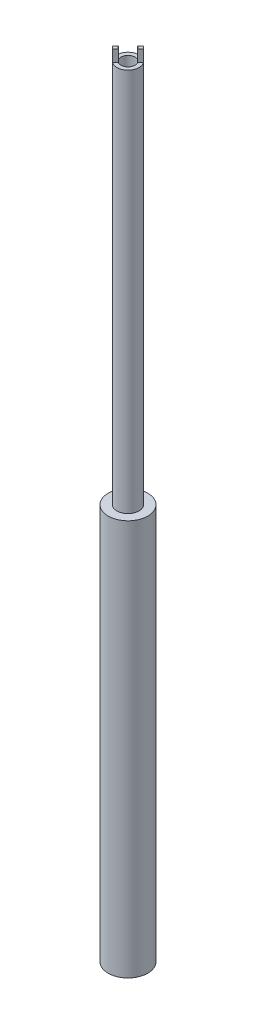
ISO-10303-21;
HEADER;
FILE_DESCRIPTION(('STEP AP214'),'2;1');
FILE_NAME('part.step','',(''),(''),'','','');
FILE_SCHEMA(('AUTOMOTIVE_DESIGN { 1 0 10303 214 1 1 1 1 }'));
ENDSEC;
DATA;
#1=APPLICATION_CONTEXT('core data for automotive mechanical design processes');
#2=APPLICATION_PROTOCOL_DEFINITION('international standard','automotive_design',2000,#1);
#3=PRODUCT_CONTEXT('',#1,'mechanical');
#4=PRODUCT('Part','Part','',(#3));
#5=PRODUCT_RELATED_PRODUCT_CATEGORY('part','',(#4));
#6=PRODUCT_DEFINITION_FORMATION('','',#4);
#7=PRODUCT_DEFINITION_CONTEXT('part definition',#1,'design');
#8=PRODUCT_DEFINITION('design','',#6,#7);
#9=PRODUCT_DEFINITION_SHAPE('','',#8);
#10=(LENGTH_UNIT() NAMED_UNIT(*) SI_UNIT(.MILLI.,.METRE.));
#11=(NAMED_UNIT(*) PLANE_ANGLE_UNIT() SI_UNIT($,.RADIAN.));
#12=(NAMED_UNIT(*) SI_UNIT($,.STERADIAN.) SOLID_ANGLE_UNIT());
#13=UNCERTAINTY_MEASURE_WITH_UNIT(LENGTH_MEASURE(1.E-05),#10,'distance_accuracy_value','');
#14=(GEOMETRIC_REPRESENTATION_CONTEXT(3) GLOBAL_UNCERTAINTY_ASSIGNED_CONTEXT((#13)) GLOBAL_UNIT_ASSIGNED_CONTEXT((#10,
#11,#12)) REPRESENTATION_CONTEXT('',''));
#15=CARTESIAN_POINT('',(0.,0.,0.));
#16=DIRECTION('',(0.,0.,1.));
#17=DIRECTION('',(1.,0.,0.));
#18=AXIS2_PLACEMENT_3D('',#15,#16,#17);
#19=CARTESIAN_POINT('',(0.,100.,0.));
#20=DIRECTION('',(0.,1.,0.));
#21=DIRECTION('',(0.,0.,1.));
#22=AXIS2_PLACEMENT_3D('',#19,#20,#21);
#23=PLANE('',#22);
#24=DIRECTION('',(-0.707106781186551,0.,0.707106781186544));
#25=VECTOR('',#24,1.);
#26=CARTESIAN_POINT('',(1.21975919754681,100.,-0.901561146012855));
#27=LINE('',#26,#25);
#28=CARTESIAN_POINT('',(1.12829869559771,100.,-0.810100644063753));
#29=VERTEX_POINT('',#28);
#30=CARTESIAN_POINT('',(0.767250322731802,100.,-0.449052271197849));
#31=VERTEX_POINT('',#30);
#32=EDGE_CURVE('E99',#29,#31,#27,.T.);
#33=ORIENTED_EDGE('',*,*,#32,.F.);
#34=CARTESIAN_POINT('',(0.,100.,0.));
#35=DIRECTION('',(0.,1.,0.));
#36=DIRECTION('',(0.,0.,1.));
#37=AXIS2_PLACEMENT_3D('',#34,#35,#36);
#38=CIRCLE('',#37,1.389);
#39=CARTESIAN_POINT('',(0.810100644063765,100.,-1.1282986955977));
#40=VERTEX_POINT('',#39);
#41=EDGE_CURVE('E110',#29,#40,#38,.T.);
#42=ORIENTED_EDGE('',*,*,#41,.T.);
#43=DIRECTION('',(0.707106781186551,0.,-0.707106781186544));
#44=VECTOR('',#43,1.);
#45=CARTESIAN_POINT('',(0.901561146012861,100.,-1.2197591975468));
#46=LINE('',#45,#44);
#47=CARTESIAN_POINT('',(0.449052271197857,100.,-0.767250322731797));
#48=VERTEX_POINT('',#47);
#49=EDGE_CURVE('E104',#48,#40,#46,.T.);
#50=ORIENTED_EDGE('',*,*,#49,.F.);
#51=CARTESIAN_POINT('',(0.,100.,0.));
#52=DIRECTION('',(0.,1.,0.));
#53=DIRECTION('',(0.,0.,1.));
#54=AXIS2_PLACEMENT_3D('',#51,#52,#53);
#55=CIRCLE('',#54,0.889);
#56=EDGE_CURVE('E112',#31,#48,#55,.T.);
#57=ORIENTED_EDGE('',*,*,#56,.F.);
#58=EDGE_LOOP('',(#33,#42,#50,#57));
#59=FACE_BOUND('',#58,.T.);
#60=ADVANCED_FACE('F33',(#59),#23,.T.);
#61=CARTESIAN_POINT('',(-0.449052271197857,100.,0.767250322731797));
#62=VERTEX_POINT('',#61);
#63=CARTESIAN_POINT('',(-0.810100644063765,100.,1.1282986955977));
#64=VERTEX_POINT('',#63);
#65=EDGE_CURVE('E114',#62,#64,#27,.T.);
#66=ORIENTED_EDGE('',*,*,#65,.F.);
#67=CARTESIAN_POINT('',(-0.767250322731801,100.,0.449052271197849));
#68=VERTEX_POINT('',#67);
#69=EDGE_CURVE('E121',#68,#62,#55,.T.);
#70=ORIENTED_EDGE('',*,*,#69,.F.);
#71=CARTESIAN_POINT('',(-1.12829869559771,100.,0.810100644063753));
#72=VERTEX_POINT('',#71);
#73=EDGE_CURVE('E161',#72,#68,#46,.T.);
#74=ORIENTED_EDGE('',*,*,#73,.F.);
#75=EDGE_CURVE('E120',#72,#64,#38,.T.);
#76=ORIENTED_EDGE('',*,*,#75,.T.);
#77=EDGE_LOOP('',(#66,#70,#74,#76));
#78=FACE_BOUND('',#77,.T.);
#79=ADVANCED_FACE('F150',(#78),#23,.T.);
#80=CARTESIAN_POINT('',(0.,100.,0.));
#81=DIRECTION('',(0.,-1.,0.));
#82=DIRECTION('',(0.,0.,-1.));
#83=AXIS2_PLACEMENT_3D('',#80,#81,#82);
#84=CYLINDRICAL_SURFACE('',#83,1.389);
#85=ORIENTED_EDGE('',*,*,#41,.F.);
#86=DIRECTION('',(0.,-1.,0.));
#87=VECTOR('',#86,1.);
#88=CARTESIAN_POINT('',(1.12829869559771,100.,-0.810100644063753));
#89=LINE('',#88,#87);
#90=CARTESIAN_POINT('',(1.12829869559771,98.5,-0.810100644063753));
#91=VERTEX_POINT('',#90);
#92=EDGE_CURVE('E96',#29,#91,#89,.T.);
#93=ORIENTED_EDGE('',*,*,#92,.T.);
#94=CARTESIAN_POINT('',(0.,98.5,0.));
#95=DIRECTION('',(0.,1.,0.));
#96=DIRECTION('',(0.,0.,1.));
#97=AXIS2_PLACEMENT_3D('',#94,#95,#96);
#98=CIRCLE('',#97,1.389);
#99=CARTESIAN_POINT('',(-0.810100644063765,98.5,1.1282986955977));
#100=VERTEX_POINT('',#99);
#101=EDGE_CURVE('E184',#100,#91,#98,.T.);
#102=ORIENTED_EDGE('',*,*,#101,.F.);
#103=DIRECTION('',(0.,-1.,0.));
#104=VECTOR('',#103,1.);
#105=CARTESIAN_POINT('',(-0.810100644063765,100.,1.1282986955977));
#106=LINE('',#105,#104);
#107=EDGE_CURVE('E105',#100,#64,#106,.F.);
#108=ORIENTED_EDGE('',*,*,#107,.T.);
#109=ORIENTED_EDGE('',*,*,#75,.F.);
#110=DIRECTION('',(0.,-1.,0.));
#111=VECTOR('',#110,1.);
#112=CARTESIAN_POINT('',(-1.12829869559771,100.,0.810100644063753));
#113=LINE('',#112,#111);
#114=CARTESIAN_POINT('',(-1.12829869559771,98.5,0.810100644063753));
#115=VERTEX_POINT('',#114);
#116=EDGE_CURVE('E162',#72,#115,#113,.T.);
#117=ORIENTED_EDGE('',*,*,#116,.T.);
#118=CARTESIAN_POINT('',(0.,98.5,0.));
#119=DIRECTION('',(0.,-1.,0.));
#120=DIRECTION('',(0.,0.,-1.));
#121=AXIS2_PLACEMENT_3D('',#118,#119,#120);
#122=CIRCLE('',#121,1.389);
#123=CARTESIAN_POINT('',(0.810100644063765,98.5,-1.1282986955977));
#124=VERTEX_POINT('',#123);
#125=EDGE_CURVE('E168',#115,#124,#122,.T.);
#126=ORIENTED_EDGE('',*,*,#125,.T.);
#127=DIRECTION('',(0.,-1.,0.));
#128=VECTOR('',#127,1.);
#129=CARTESIAN_POINT('',(0.810100644063765,100.,-1.1282986955977));
#130=LINE('',#129,#128);
#131=EDGE_CURVE('E119',#124,#40,#130,.F.);
#132=ORIENTED_EDGE('',*,*,#131,.T.);
#133=EDGE_LOOP('',(#85,#93,#102,#108,#109,#117,#126,#132));
#134=FACE_BOUND('',#133,.T.);
#135=CARTESIAN_POINT('',(0.,50.,0.));
#136=DIRECTION('',(0.,1.,0.));
#137=DIRECTION('',(0.,0.,1.));
#138=AXIS2_PLACEMENT_3D('',#135,#136,#137);
#139=CIRCLE('',#138,1.389);
#140=CARTESIAN_POINT('',(0.,50.,1.389));
#141=VERTEX_POINT('',#140);
#142=EDGE_CURVE('E176',#141,#141,#139,.T.);
#143=ORIENTED_EDGE('',*,*,#142,.T.);
#144=EDGE_LOOP('',(#143));
#145=FACE_BOUND('',#144,.T.);
#146=ADVANCED_FACE('F35',(#134,#145),#84,.T.);
#147=CARTESIAN_POINT('',(0.,100.,0.));
#148=DIRECTION('',(0.,-1.,0.));
#149=DIRECTION('',(0.,0.,-1.));
#150=AXIS2_PLACEMENT_3D('',#147,#148,#149);
#151=CYLINDRICAL_SURFACE('',#150,0.889);
#152=DIRECTION('',(0.,-1.,0.));
#153=VECTOR('',#152,1.);
#154=CARTESIAN_POINT('',(0.767250322731802,100.,-0.449052271197849));
#155=LINE('',#154,#153);
#156=CARTESIAN_POINT('',(0.767250322731802,98.5,-0.449052271197849));
#157=VERTEX_POINT('',#156);
#158=EDGE_CURVE('E11',#31,#157,#155,.T.);
#159=ORIENTED_EDGE('',*,*,#158,.F.);
#160=ORIENTED_EDGE('',*,*,#56,.T.);
#161=DIRECTION('',(0.,-1.,0.));
#162=VECTOR('',#161,1.);
#163=CARTESIAN_POINT('',(0.449052271197857,100.,-0.767250322731797));
#164=LINE('',#163,#162);
#165=CARTESIAN_POINT('',(0.449052271197857,98.5,-0.767250322731797));
#166=VERTEX_POINT('',#165);
#167=EDGE_CURVE('E133',#166,#48,#164,.F.);
#168=ORIENTED_EDGE('',*,*,#167,.F.);
#169=CARTESIAN_POINT('',(0.,98.5,0.));
#170=DIRECTION('',(0.,-1.,0.));
#171=DIRECTION('',(0.,0.,-1.));
#172=AXIS2_PLACEMENT_3D('',#169,#170,#171);
#173=CIRCLE('',#172,0.889);
#174=CARTESIAN_POINT('',(-0.767250322731801,98.5,0.449052271197849));
#175=VERTEX_POINT('',#174);
#176=EDGE_CURVE('E131',#175,#166,#173,.T.);
#177=ORIENTED_EDGE('',*,*,#176,.F.);
#178=DIRECTION('',(0.,-1.,0.));
#179=VECTOR('',#178,1.);
#180=CARTESIAN_POINT('',(-0.767250322731801,100.,0.449052271197849));
#181=LINE('',#180,#179);
#182=EDGE_CURVE('E136',#68,#175,#181,.T.);
#183=ORIENTED_EDGE('',*,*,#182,.F.);
#184=ORIENTED_EDGE('',*,*,#69,.T.);
#185=DIRECTION('',(0.,-1.,0.));
#186=VECTOR('',#185,1.);
#187=CARTESIAN_POINT('',(-0.449052271197857,100.,0.767250322731797));
#188=LINE('',#187,#186);
#189=CARTESIAN_POINT('',(-0.449052271197857,98.5,0.767250322731797));
#190=VERTEX_POINT('',#189);
#191=EDGE_CURVE('E41',#190,#62,#188,.F.);
#192=ORIENTED_EDGE('',*,*,#191,.F.);
#193=CARTESIAN_POINT('',(0.,98.5,0.));
#194=DIRECTION('',(0.,1.,0.));
#195=DIRECTION('',(0.,0.,1.));
#196=AXIS2_PLACEMENT_3D('',#193,#194,#195);
#197=CIRCLE('',#196,0.889);
#198=EDGE_CURVE('E138',#190,#157,#197,.T.);
#199=ORIENTED_EDGE('',*,*,#198,.T.);
#200=EDGE_LOOP('',(#159,#160,#168,#177,#183,#184,#192,#199));
#201=FACE_BOUND('',#200,.T.);
#202=CARTESIAN_POINT('',(0.,50.,0.));
#203=DIRECTION('',(0.,1.,0.));
#204=DIRECTION('',(0.,0.,1.));
#205=AXIS2_PLACEMENT_3D('',#202,#203,#204);
#206=CIRCLE('',#205,0.889);
#207=CARTESIAN_POINT('',(0.,50.,0.889));
#208=VERTEX_POINT('',#207);
#209=EDGE_CURVE('E124',#208,#208,#206,.T.);
#210=ORIENTED_EDGE('',*,*,#209,.F.);
#211=EDGE_LOOP('',(#210));
#212=FACE_BOUND('',#211,.T.);
#213=ADVANCED_FACE('F154',(#201,#212),#151,.F.);
#214=CARTESIAN_POINT('',(0.,50.,0.));
#215=DIRECTION('',(0.,1.,0.));
#216=DIRECTION('',(0.,0.,1.));
#217=AXIS2_PLACEMENT_3D('',#214,#215,#216);
#218=PLANE('',#217);
#219=ORIENTED_EDGE('',*,*,#209,.T.);
#220=EDGE_LOOP('',(#219));
#221=FACE_BOUND('',#220,.T.);
#222=ADVANCED_FACE('F218',(#221),#218,.T.);
#223=CARTESIAN_POINT('',(0.,50.,0.));
#224=DIRECTION('',(0.,1.,0.));
#225=DIRECTION('',(0.,0.,1.));
#226=AXIS2_PLACEMENT_3D('',#223,#224,#225);
#227=CIRCLE('',#226,2.5);
#228=CARTESIAN_POINT('',(0.,50.,2.5));
#229=VERTEX_POINT('',#228);
#230=EDGE_CURVE('E173',#229,#229,#227,.T.);
#231=ORIENTED_EDGE('',*,*,#230,.T.);
#232=EDGE_LOOP('',(#231));
#233=FACE_BOUND('',#232,.T.);
#234=ORIENTED_EDGE('',*,*,#142,.F.);
#235=EDGE_LOOP('',(#234));
#236=FACE_BOUND('',#235,.T.);
#237=ADVANCED_FACE('F211',(#233,#236),#218,.T.);
#238=CARTESIAN_POINT('',(0.,50.,0.));
#239=DIRECTION('',(0.,-1.,0.));
#240=DIRECTION('',(0.,0.,-1.));
#241=AXIS2_PLACEMENT_3D('',#238,#239,#240);
#242=CYLINDRICAL_SURFACE('',#241,2.5);
#243=ORIENTED_EDGE('',*,*,#230,.F.);
#244=EDGE_LOOP('',(#243));
#245=FACE_BOUND('',#244,.T.);
#246=CARTESIAN_POINT('',(0.,0.,0.));
#247=DIRECTION('',(0.,1.,0.));
#248=DIRECTION('',(0.,0.,1.));
#249=AXIS2_PLACEMENT_3D('',#246,#247,#248);
#250=CIRCLE('',#249,2.5);
#251=CARTESIAN_POINT('',(0.,0.,2.5));
#252=VERTEX_POINT('',#251);
#253=EDGE_CURVE('E172',#252,#252,#250,.T.);
#254=ORIENTED_EDGE('',*,*,#253,.T.);
#255=EDGE_LOOP('',(#254));
#256=FACE_BOUND('',#255,.T.);
#257=ADVANCED_FACE('F204',(#245,#256),#242,.T.);
#258=CARTESIAN_POINT('',(0.,0.,0.));
#259=DIRECTION('',(0.,1.,0.));
#260=DIRECTION('',(0.,0.,1.));
#261=AXIS2_PLACEMENT_3D('',#258,#259,#260);
#262=PLANE('',#261);
#263=ORIENTED_EDGE('',*,*,#253,.F.);
#264=EDGE_LOOP('',(#263));
#265=FACE_BOUND('',#264,.T.);
#266=ADVANCED_FACE('F202',(#265),#262,.F.);
#267=CARTESIAN_POINT('',(0.901561146012861,98.5,-1.2197591975468));
#268=DIRECTION('',(0.707106781186544,0.,0.707106781186551));
#269=DIRECTION('',(0.707106781186551,0.,-0.707106781186544));
#270=AXIS2_PLACEMENT_3D('',#267,#268,#269);
#271=PLANE('',#270);
#272=ORIENTED_EDGE('',*,*,#73,.T.);
#273=ORIENTED_EDGE('',*,*,#182,.T.);
#274=DIRECTION('',(0.707106781186551,0.,-0.707106781186544));
#275=VECTOR('',#274,1.);
#276=CARTESIAN_POINT('',(0.901561146012861,98.5,-1.2197591975468));
#277=LINE('',#276,#275);
#278=EDGE_CURVE('E55',#115,#175,#277,.T.);
#279=ORIENTED_EDGE('',*,*,#278,.F.);
#280=ORIENTED_EDGE('',*,*,#116,.F.);
#281=EDGE_LOOP('',(#272,#273,#279,#280));
#282=FACE_BOUND('',#281,.T.);
#283=ADVANCED_FACE('F159',(#282),#271,.F.);
#284=EDGE_CURVE('E163',#166,#124,#277,.T.);
#285=ORIENTED_EDGE('',*,*,#284,.F.);
#286=ORIENTED_EDGE('',*,*,#167,.T.);
#287=ORIENTED_EDGE('',*,*,#49,.T.);
#288=ORIENTED_EDGE('',*,*,#131,.F.);
#289=EDGE_LOOP('',(#285,#286,#287,#288));
#290=FACE_BOUND('',#289,.T.);
#291=ADVANCED_FACE('F182',(#290),#271,.F.);
#292=CARTESIAN_POINT('',(0.,98.5,0.));
#293=DIRECTION('',(0.,-1.,0.));
#294=DIRECTION('',(0.,0.,-1.));
#295=AXIS2_PLACEMENT_3D('',#292,#293,#294);
#296=PLANE('',#295);
#297=ORIENTED_EDGE('',*,*,#278,.T.);
#298=ORIENTED_EDGE('',*,*,#176,.T.);
#299=ORIENTED_EDGE('',*,*,#284,.T.);
#300=ORIENTED_EDGE('',*,*,#125,.F.);
#301=EDGE_LOOP('',(#297,#298,#299,#300));
#302=FACE_BOUND('',#301,.T.);
#303=ADVANCED_FACE('F183',(#302),#296,.F.);
#304=CARTESIAN_POINT('',(1.21975919754681,98.5,-0.901561146012855));
#305=DIRECTION('',(-0.707106781186544,0.,-0.707106781186551));
#306=DIRECTION('',(-0.707106781186551,0.,0.707106781186544));
#307=AXIS2_PLACEMENT_3D('',#304,#305,#306);
#308=PLANE('',#307);
#309=ORIENTED_EDGE('',*,*,#32,.T.);
#310=ORIENTED_EDGE('',*,*,#158,.T.);
#311=DIRECTION('',(-0.707106781186551,0.,0.707106781186544));
#312=VECTOR('',#311,1.);
#313=CARTESIAN_POINT('',(1.21975919754681,98.5,-0.901561146012855));
#314=LINE('',#313,#312);
#315=EDGE_CURVE('E48',#91,#157,#314,.T.);
#316=ORIENTED_EDGE('',*,*,#315,.F.);
#317=ORIENTED_EDGE('',*,*,#92,.F.);
#318=EDGE_LOOP('',(#309,#310,#316,#317));
#319=FACE_BOUND('',#318,.T.);
#320=ADVANCED_FACE('F98',(#319),#308,.F.);
#321=EDGE_CURVE('E113',#190,#100,#314,.T.);
#322=ORIENTED_EDGE('',*,*,#321,.F.);
#323=ORIENTED_EDGE('',*,*,#191,.T.);
#324=ORIENTED_EDGE('',*,*,#65,.T.);
#325=ORIENTED_EDGE('',*,*,#107,.F.);
#326=EDGE_LOOP('',(#322,#323,#324,#325));
#327=FACE_BOUND('',#326,.T.);
#328=ADVANCED_FACE('F144',(#327),#308,.F.);
#329=CARTESIAN_POINT('',(0.,98.5,0.));
#330=DIRECTION('',(0.,1.,0.));
#331=DIRECTION('',(0.,0.,1.));
#332=AXIS2_PLACEMENT_3D('',#329,#330,#331);
#333=PLANE('',#332);
#334=ORIENTED_EDGE('',*,*,#101,.T.);
#335=ORIENTED_EDGE('',*,*,#315,.T.);
#336=ORIENTED_EDGE('',*,*,#198,.F.);
#337=ORIENTED_EDGE('',*,*,#321,.T.);
#338=EDGE_LOOP('',(#334,#335,#336,#337));
#339=FACE_BOUND('',#338,.T.);
#340=ADVANCED_FACE('F188',(#339),#333,.T.);
#341=CLOSED_SHELL('',(#60,#79,#146,#213,#222,#237,#257,#266,#283,#291,#303,#320,#328,#340));
#342=MANIFOLD_SOLID_BREP('B2',#341);
#343=ADVANCED_BREP_SHAPE_REPRESENTATION('',(#18,#342),#14);
#344=SHAPE_DEFINITION_REPRESENTATION(#9,#343);
ENDSEC;
END-ISO-10303-21;
